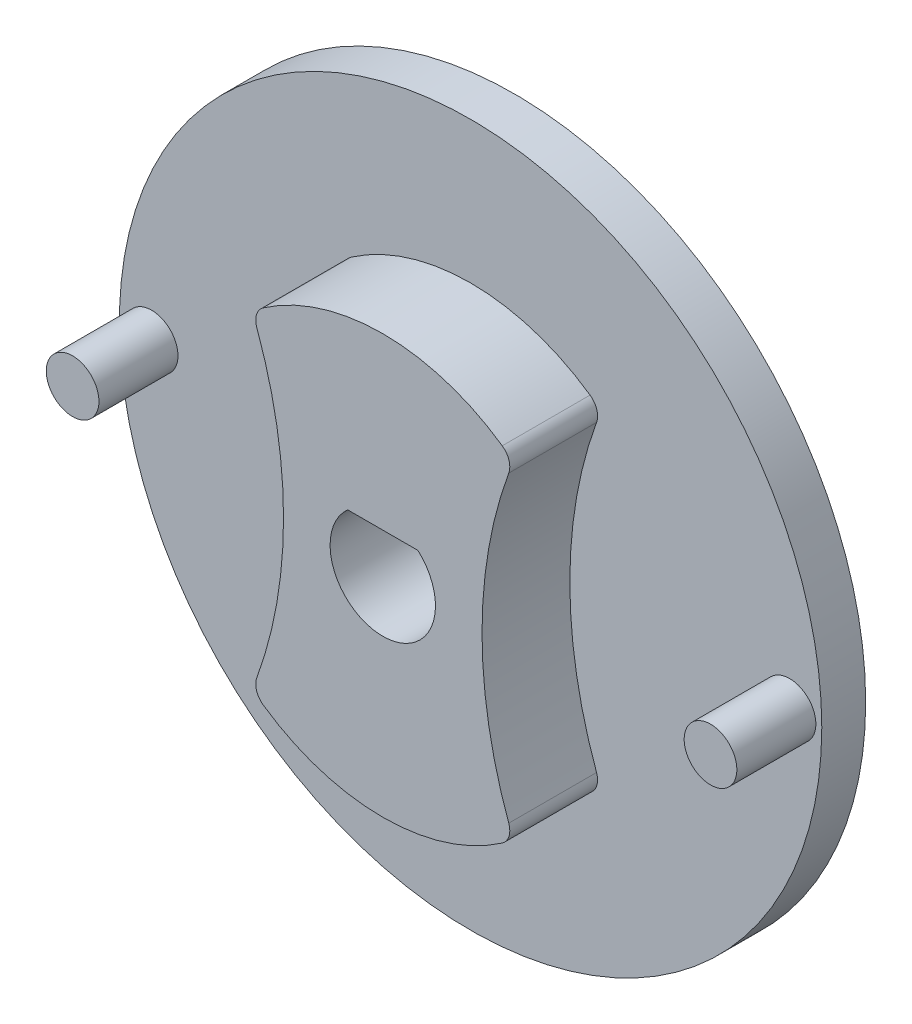
ISO-10303-21;
HEADER;
FILE_DESCRIPTION(('STEP AP214'),'2;1');
FILE_NAME('part.step','',(''),(''),'','','');
FILE_SCHEMA(('AUTOMOTIVE_DESIGN { 1 0 10303 214 1 1 1 1 }'));
ENDSEC;
DATA;
#1=APPLICATION_CONTEXT('core data for automotive mechanical design processes');
#2=APPLICATION_PROTOCOL_DEFINITION('international standard','automotive_design',2000,#1);
#3=PRODUCT_CONTEXT('',#1,'mechanical');
#4=PRODUCT('Part','Part','',(#3));
#5=PRODUCT_RELATED_PRODUCT_CATEGORY('part','',(#4));
#6=PRODUCT_DEFINITION_FORMATION('','',#4);
#7=PRODUCT_DEFINITION_CONTEXT('part definition',#1,'design');
#8=PRODUCT_DEFINITION('design','',#6,#7);
#9=PRODUCT_DEFINITION_SHAPE('','',#8);
#10=(LENGTH_UNIT() NAMED_UNIT(*) SI_UNIT(.MILLI.,.METRE.));
#11=(NAMED_UNIT(*) PLANE_ANGLE_UNIT() SI_UNIT($,.RADIAN.));
#12=(NAMED_UNIT(*) SI_UNIT($,.STERADIAN.) SOLID_ANGLE_UNIT());
#13=UNCERTAINTY_MEASURE_WITH_UNIT(LENGTH_MEASURE(1.E-05),#10,'distance_accuracy_value','');
#14=(GEOMETRIC_REPRESENTATION_CONTEXT(3) GLOBAL_UNCERTAINTY_ASSIGNED_CONTEXT((#13)) GLOBAL_UNIT_ASSIGNED_CONTEXT((#10,
#11,#12)) REPRESENTATION_CONTEXT('',''));
#15=CARTESIAN_POINT('',(0.,0.,0.));
#16=DIRECTION('',(0.,0.,1.));
#17=DIRECTION('',(1.,0.,0.));
#18=AXIS2_PLACEMENT_3D('',#15,#16,#17);
#19=CARTESIAN_POINT('',(19.6190681186798,0.948424737458792,4.99999999999989));
#20=DIRECTION('',(0.,0.,-1.));
#21=DIRECTION('',(-1.,0.,0.));
#22=AXIS2_PLACEMENT_3D('',#19,#20,#21);
#23=CYLINDRICAL_SURFACE('',#22,11.9262745781209);
#24=CARTESIAN_POINT('',(19.6190681186798,0.948424737458792,4.99999999999989));
#25=DIRECTION('',(0.,0.,1.));
#26=DIRECTION('',(1.,0.,0.));
#27=AXIS2_PLACEMENT_3D('',#24,#25,#26);
#28=CIRCLE('',#27,11.9262745781209);
#29=CARTESIAN_POINT('',(12.8153360364767,-8.84674014458034,5.));
#30=VERTEX_POINT('',#29);
#31=CARTESIAN_POINT('',(26.422800200883,-8.84674014458034,5.));
#32=VERTEX_POINT('',#31);
#33=EDGE_CURVE('E199',#30,#32,#28,.T.);
#34=ORIENTED_EDGE('',*,*,#33,.F.);
#35=DIRECTION('',(0.,0.,-1.));
#36=VECTOR('',#35,1.);
#37=CARTESIAN_POINT('',(12.8153360364767,-8.84674014458034,5.));
#38=LINE('',#37,#36);
#39=CARTESIAN_POINT('',(12.8153360364767,-8.84674014458031,0.));
#40=VERTEX_POINT('',#39);
#41=EDGE_CURVE('E232',#30,#40,#38,.T.);
#42=ORIENTED_EDGE('',*,*,#41,.T.);
#43=CARTESIAN_POINT('',(19.6190681186799,0.948424737458792,-1.11022302462516E-13));
#44=DIRECTION('',(0.,0.,1.));
#45=DIRECTION('',(1.,0.,0.));
#46=AXIS2_PLACEMENT_3D('',#43,#44,#45);
#47=CIRCLE('',#46,11.9262745781209);
#48=CARTESIAN_POINT('',(26.422800200883,-8.84674014458034,0.));
#49=VERTEX_POINT('',#48);
#50=EDGE_CURVE('E195',#40,#49,#47,.T.);
#51=ORIENTED_EDGE('',*,*,#50,.T.);
#52=DIRECTION('',(0.,0.,-1.));
#53=VECTOR('',#52,1.);
#54=CARTESIAN_POINT('',(26.422800200883,-8.84674014458034,5.));
#55=LINE('',#54,#53);
#56=EDGE_CURVE('E216',#49,#32,#55,.F.);
#57=ORIENTED_EDGE('',*,*,#56,.T.);
#58=EDGE_LOOP('',(#34,#42,#51,#57));
#59=FACE_BOUND('',#58,.T.);
#60=ADVANCED_FACE('F65',(#59),#23,.T.);
#61=CARTESIAN_POINT('',(50.5207675561745,0.948424737458792,5.));
#62=DIRECTION('',(0.,0.,-1.));
#63=DIRECTION('',(-1.,0.,0.));
#64=AXIS2_PLACEMENT_3D('',#61,#62,#63);
#65=CYLINDRICAL_SURFACE('',#64,25.25);
#66=CARTESIAN_POINT('',(50.5207675561745,0.948424737458792,5.));
#67=DIRECTION('',(0.,0.,-1.));
#68=DIRECTION('',(-1.,0.,0.));
#69=AXIS2_PLACEMENT_3D('',#66,#67,#68);
#70=CIRCLE('',#69,25.25);
#71=CARTESIAN_POINT('',(26.7920680791963,-7.68356930396963,5.));
#72=VERTEX_POINT('',#71);
#73=CARTESIAN_POINT('',(26.7920680791963,9.58041877888713,5.));
#74=VERTEX_POINT('',#73);
#75=EDGE_CURVE('E203',#72,#74,#70,.T.);
#76=ORIENTED_EDGE('',*,*,#75,.F.);
#77=DIRECTION('',(0.,0.,-1.));
#78=VECTOR('',#77,1.);
#79=CARTESIAN_POINT('',(26.7920680791963,-7.68356930396963,5.));
#80=LINE('',#79,#78);
#81=CARTESIAN_POINT('',(26.7920680791963,-7.6835693039696,0.));
#82=VERTEX_POINT('',#81);
#83=EDGE_CURVE('E258',#72,#82,#80,.T.);
#84=ORIENTED_EDGE('',*,*,#83,.T.);
#85=CARTESIAN_POINT('',(50.5207675561745,0.94842473745882,0.));
#86=DIRECTION('',(0.,0.,-1.));
#87=DIRECTION('',(-1.,0.,0.));
#88=AXIS2_PLACEMENT_3D('',#85,#86,#87);
#89=CIRCLE('',#88,25.25);
#90=CARTESIAN_POINT('',(26.7920680791963,9.58041877888716,0.));
#91=VERTEX_POINT('',#90);
#92=EDGE_CURVE('E220',#82,#91,#89,.T.);
#93=ORIENTED_EDGE('',*,*,#92,.T.);
#94=DIRECTION('',(0.,0.,-1.));
#95=VECTOR('',#94,1.);
#96=CARTESIAN_POINT('',(26.7920680791963,9.58041877888713,5.));
#97=LINE('',#96,#95);
#98=EDGE_CURVE('E255',#91,#74,#97,.F.);
#99=ORIENTED_EDGE('',*,*,#98,.T.);
#100=EDGE_LOOP('',(#76,#84,#93,#99));
#101=FACE_BOUND('',#100,.T.);
#102=ADVANCED_FACE('F280',(#101),#65,.F.);
#103=CARTESIAN_POINT('',(19.6190681186798,0.948424737458792,4.99999999999989));
#104=DIRECTION('',(0.,0.,-1.));
#105=DIRECTION('',(-1.,0.,0.));
#106=AXIS2_PLACEMENT_3D('',#103,#104,#105);
#107=CYLINDRICAL_SURFACE('',#106,11.9262745781209);
#108=CARTESIAN_POINT('',(19.6190681186798,0.948424737458792,4.99999999999989));
#109=DIRECTION('',(0.,0.,1.));
#110=DIRECTION('',(1.,0.,0.));
#111=AXIS2_PLACEMENT_3D('',#108,#109,#110);
#112=CIRCLE('',#111,11.9262745781209);
#113=CARTESIAN_POINT('',(26.422800200883,10.7435896194979,5.));
#114=VERTEX_POINT('',#113);
#115=CARTESIAN_POINT('',(12.8153360364767,10.7435896194979,4.99999999999989));
#116=VERTEX_POINT('',#115);
#117=EDGE_CURVE('E208',#114,#116,#112,.T.);
#118=ORIENTED_EDGE('',*,*,#117,.F.);
#119=DIRECTION('',(0.,0.,-1.));
#120=VECTOR('',#119,1.);
#121=CARTESIAN_POINT('',(26.422800200883,10.7435896194979,5.));
#122=LINE('',#121,#120);
#123=CARTESIAN_POINT('',(26.422800200883,10.7435896194979,0.));
#124=VERTEX_POINT('',#123);
#125=EDGE_CURVE('E265',#114,#124,#122,.T.);
#126=ORIENTED_EDGE('',*,*,#125,.T.);
#127=CARTESIAN_POINT('',(19.6190681186799,0.948424737458792,-1.11022302462516E-13));
#128=DIRECTION('',(0.,0.,1.));
#129=DIRECTION('',(1.,0.,0.));
#130=AXIS2_PLACEMENT_3D('',#127,#128,#129);
#131=CIRCLE('',#130,11.9262745781209);
#132=CARTESIAN_POINT('',(12.8153360364767,10.7435896194979,-1.11022302462516E-13));
#133=VERTEX_POINT('',#132);
#134=EDGE_CURVE('E224',#124,#133,#131,.T.);
#135=ORIENTED_EDGE('',*,*,#134,.T.);
#136=DIRECTION('',(0.,0.,-1.));
#137=VECTOR('',#136,1.);
#138=CARTESIAN_POINT('',(12.8153360364767,10.7435896194979,4.99999999999989));
#139=LINE('',#138,#137);
#140=EDGE_CURVE('E262',#133,#116,#139,.F.);
#141=ORIENTED_EDGE('',*,*,#140,.T.);
#142=EDGE_LOOP('',(#118,#126,#135,#141));
#143=FACE_BOUND('',#142,.T.);
#144=ADVANCED_FACE('F287',(#143),#107,.T.);
#145=CARTESIAN_POINT('',(-11.2826313188148,0.948424737458736,5.));
#146=DIRECTION('',(0.,0.,-1.));
#147=DIRECTION('',(-1.,0.,0.));
#148=AXIS2_PLACEMENT_3D('',#145,#146,#147);
#149=CYLINDRICAL_SURFACE('',#148,25.25);
#150=CARTESIAN_POINT('',(-11.2826313188148,0.948424737458736,0.));
#151=DIRECTION('',(0.,0.,-1.));
#152=DIRECTION('',(1.,0.,0.));
#153=AXIS2_PLACEMENT_3D('',#150,#151,#152);
#154=CIRCLE('',#153,25.25);
#155=CARTESIAN_POINT('',(12.4460681581634,9.58041877888718,0.));
#156=VERTEX_POINT('',#155);
#157=CARTESIAN_POINT('',(12.4460681581634,-7.6835693039696,0.));
#158=VERTEX_POINT('',#157);
#159=EDGE_CURVE('E204',#156,#158,#154,.T.);
#160=ORIENTED_EDGE('',*,*,#159,.T.);
#161=DIRECTION('',(0.,0.,-1.));
#162=VECTOR('',#161,1.);
#163=CARTESIAN_POINT('',(12.4460681581634,-7.6835693039696,5.));
#164=LINE('',#163,#162);
#165=CARTESIAN_POINT('',(12.4460681581634,-7.6835693039696,5.));
#166=VERTEX_POINT('',#165);
#167=EDGE_CURVE('E240',#158,#166,#164,.F.);
#168=ORIENTED_EDGE('',*,*,#167,.T.);
#169=CARTESIAN_POINT('',(-11.2826313188148,0.948424737458736,5.));
#170=DIRECTION('',(0.,0.,-1.));
#171=DIRECTION('',(1.,0.,0.));
#172=AXIS2_PLACEMENT_3D('',#169,#170,#171);
#173=CIRCLE('',#172,25.25);
#174=CARTESIAN_POINT('',(12.4460681581634,9.58041877888718,5.));
#175=VERTEX_POINT('',#174);
#176=EDGE_CURVE('E212',#175,#166,#173,.T.);
#177=ORIENTED_EDGE('',*,*,#176,.F.);
#178=DIRECTION('',(0.,0.,-1.));
#179=VECTOR('',#178,1.);
#180=CARTESIAN_POINT('',(12.4460681581634,9.58041877888718,5.));
#181=LINE('',#180,#179);
#182=EDGE_CURVE('E236',#175,#156,#181,.T.);
#183=ORIENTED_EDGE('',*,*,#182,.T.);
#184=EDGE_LOOP('',(#160,#168,#177,#183));
#185=FACE_BOUND('',#184,.T.);
#186=ADVANCED_FACE('F294',(#185),#149,.F.);
#187=CARTESIAN_POINT('',(35.0699178374272,0.948424737458764,5.));
#188=DIRECTION('',(0.,0.,1.));
#189=DIRECTION('',(1.,0.,0.));
#190=AXIS2_PLACEMENT_3D('',#187,#188,#189);
#191=PLANE('',#190);
#192=CARTESIAN_POINT('',(19.6190681186798,0.948424737458792,4.99999999999989));
#193=DIRECTION('',(0.,0.,1.));
#194=DIRECTION('',(1.,0.,0.));
#195=AXIS2_PLACEMENT_3D('',#192,#193,#194);
#196=CIRCLE('',#195,3.);
#197=CARTESIAN_POINT('',(17.6190681186799,3.18449271495855,5.));
#198=VERTEX_POINT('',#197);
#199=CARTESIAN_POINT('',(21.6190681186798,3.18449271495858,4.99999999999989));
#200=VERTEX_POINT('',#199);
#201=EDGE_CURVE('E145',#198,#200,#196,.T.);
#202=ORIENTED_EDGE('',*,*,#201,.F.);
#203=DIRECTION('',(-1.,0.,0.));
#204=VECTOR('',#203,1.);
#205=CARTESIAN_POINT('',(17.6190681186799,3.18449271495855,5.));
#206=LINE('',#205,#204);
#207=EDGE_CURVE('E157',#200,#198,#206,.T.);
#208=ORIENTED_EDGE('',*,*,#207,.F.);
#209=EDGE_LOOP('',(#202,#208));
#210=FACE_BOUND('',#209,.T.);
#211=ORIENTED_EDGE('',*,*,#176,.T.);
#212=CARTESIAN_POINT('',(13.3858186324992,-8.02543045412518,5.));
#213=DIRECTION('',(0.,0.,1.));
#214=DIRECTION('',(1.,0.,0.));
#215=AXIS2_PLACEMENT_3D('',#212,#213,#214);
#216=CIRCLE('',#215,1.);
#217=EDGE_CURVE('E252',#166,#30,#216,.T.);
#218=ORIENTED_EDGE('',*,*,#217,.T.);
#219=ORIENTED_EDGE('',*,*,#33,.T.);
#220=CARTESIAN_POINT('',(25.8523176048605,-8.02543045412521,5.));
#221=DIRECTION('',(0.,0.,1.));
#222=DIRECTION('',(1.,0.,0.));
#223=AXIS2_PLACEMENT_3D('',#220,#221,#222);
#224=CIRCLE('',#223,1.);
#225=EDGE_CURVE('E249',#32,#72,#224,.T.);
#226=ORIENTED_EDGE('',*,*,#225,.T.);
#227=ORIENTED_EDGE('',*,*,#75,.T.);
#228=CARTESIAN_POINT('',(25.8523176048605,9.92227992904277,5.));
#229=DIRECTION('',(0.,0.,1.));
#230=DIRECTION('',(1.,0.,0.));
#231=AXIS2_PLACEMENT_3D('',#228,#229,#230);
#232=CIRCLE('',#231,1.);
#233=EDGE_CURVE('E246',#74,#114,#232,.T.);
#234=ORIENTED_EDGE('',*,*,#233,.T.);
#235=ORIENTED_EDGE('',*,*,#117,.T.);
#236=CARTESIAN_POINT('',(13.3858186324992,9.92227992904277,5.));
#237=DIRECTION('',(0.,0.,1.));
#238=DIRECTION('',(1.,0.,0.));
#239=AXIS2_PLACEMENT_3D('',#236,#237,#238);
#240=CIRCLE('',#239,1.);
#241=EDGE_CURVE('E243',#116,#175,#240,.T.);
#242=ORIENTED_EDGE('',*,*,#241,.T.);
#243=EDGE_LOOP('',(#211,#218,#219,#226,#227,#234,#235,#242));
#244=FACE_BOUND('',#243,.T.);
#245=ADVANCED_FACE('F162',(#210,#244),#191,.T.);
#246=CARTESIAN_POINT('',(19.6190681186799,0.948424737458792,-1.11022302462516E-13));
#247=DIRECTION('',(0.,0.,1.));
#248=DIRECTION('',(1.,0.,0.));
#249=AXIS2_PLACEMENT_3D('',#246,#247,#248);
#250=PLANE('',#249);
#251=CARTESIAN_POINT('',(37.7826313188137,0.948424737458792,0.));
#252=DIRECTION('',(0.,0.,1.));
#253=DIRECTION('',(1.,0.,0.));
#254=AXIS2_PLACEMENT_3D('',#251,#252,#253);
#255=CIRCLE('',#254,1.5);
#256=CARTESIAN_POINT('',(39.2826313188137,0.948424737458792,0.));
#257=VERTEX_POINT('',#256);
#258=EDGE_CURVE('E153',#257,#257,#255,.T.);
#259=ORIENTED_EDGE('',*,*,#258,.F.);
#260=EDGE_LOOP('',(#259));
#261=FACE_BOUND('',#260,.T.);
#262=CARTESIAN_POINT('',(1.45550491854603,0.948424737458792,0.));
#263=DIRECTION('',(0.,0.,1.));
#264=DIRECTION('',(1.,0.,0.));
#265=AXIS2_PLACEMENT_3D('',#262,#263,#264);
#266=CIRCLE('',#265,1.5);
#267=CARTESIAN_POINT('',(2.95550491854603,0.948424737458792,0.));
#268=VERTEX_POINT('',#267);
#269=EDGE_CURVE('E179',#268,#268,#266,.T.);
#270=ORIENTED_EDGE('',*,*,#269,.F.);
#271=EDGE_LOOP('',(#270));
#272=FACE_BOUND('',#271,.T.);
#273=CARTESIAN_POINT('',(19.6190681186799,0.948424737458792,-1.11022302462516E-13));
#274=DIRECTION('',(0.,0.,1.));
#275=DIRECTION('',(1.,0.,0.));
#276=AXIS2_PLACEMENT_3D('',#273,#274,#275);
#277=CIRCLE('',#276,20.);
#278=CARTESIAN_POINT('',(39.6190681186799,0.948424737458792,-1.11022302462516E-13));
#279=VERTEX_POINT('',#278);
#280=EDGE_CURVE('E187',#279,#279,#277,.T.);
#281=ORIENTED_EDGE('',*,*,#280,.T.);
#282=EDGE_LOOP('',(#281));
#283=FACE_BOUND('',#282,.T.);
#284=ORIENTED_EDGE('',*,*,#50,.F.);
#285=CARTESIAN_POINT('',(13.3858186324992,-8.02543045412518,0.));
#286=DIRECTION('',(0.,0.,1.));
#287=DIRECTION('',(1.,0.,0.));
#288=AXIS2_PLACEMENT_3D('',#285,#286,#287);
#289=CIRCLE('',#288,1.);
#290=EDGE_CURVE('E268',#40,#158,#289,.F.);
#291=ORIENTED_EDGE('',*,*,#290,.T.);
#292=ORIENTED_EDGE('',*,*,#159,.F.);
#293=CARTESIAN_POINT('',(13.3858186324992,9.92227992904277,0.));
#294=DIRECTION('',(0.,0.,1.));
#295=DIRECTION('',(1.,0.,0.));
#296=AXIS2_PLACEMENT_3D('',#293,#294,#295);
#297=CIRCLE('',#296,1.);
#298=EDGE_CURVE('E13',#156,#133,#297,.F.);
#299=ORIENTED_EDGE('',*,*,#298,.T.);
#300=ORIENTED_EDGE('',*,*,#134,.F.);
#301=CARTESIAN_POINT('',(25.8523176048605,9.92227992904277,0.));
#302=DIRECTION('',(0.,0.,1.));
#303=DIRECTION('',(1.,0.,0.));
#304=AXIS2_PLACEMENT_3D('',#301,#302,#303);
#305=CIRCLE('',#304,1.);
#306=EDGE_CURVE('E74',#124,#91,#305,.F.);
#307=ORIENTED_EDGE('',*,*,#306,.T.);
#308=ORIENTED_EDGE('',*,*,#92,.F.);
#309=CARTESIAN_POINT('',(25.8523176048605,-8.02543045412518,0.));
#310=DIRECTION('',(0.,0.,1.));
#311=DIRECTION('',(1.,0.,0.));
#312=AXIS2_PLACEMENT_3D('',#309,#310,#311);
#313=CIRCLE('',#312,1.);
#314=EDGE_CURVE('E271',#82,#49,#313,.F.);
#315=ORIENTED_EDGE('',*,*,#314,.T.);
#316=EDGE_LOOP('',(#284,#291,#292,#299,#300,#307,#308,#315));
#317=FACE_BOUND('',#316,.T.);
#318=ADVANCED_FACE('F277',(#261,#272,#283,#317),#250,.T.);
#319=CARTESIAN_POINT('',(19.6190681186798,0.948424737458764,-2.50000000000006));
#320=DIRECTION('',(0.,0.,1.));
#321=DIRECTION('',(1.,0.,0.));
#322=AXIS2_PLACEMENT_3D('',#319,#320,#321);
#323=CYLINDRICAL_SURFACE('',#322,20.);
#324=CARTESIAN_POINT('',(19.6190681186798,0.948424737458764,-2.50000000000006));
#325=DIRECTION('',(0.,0.,1.));
#326=DIRECTION('',(1.,0.,0.));
#327=AXIS2_PLACEMENT_3D('',#324,#325,#326);
#328=CIRCLE('',#327,20.);
#329=CARTESIAN_POINT('',(39.6190681186799,0.948424737458764,-2.50000000000006));
#330=VERTEX_POINT('',#329);
#331=EDGE_CURVE('E191',#330,#330,#328,.T.);
#332=ORIENTED_EDGE('',*,*,#331,.T.);
#333=EDGE_LOOP('',(#332));
#334=FACE_BOUND('',#333,.T.);
#335=ORIENTED_EDGE('',*,*,#280,.F.);
#336=EDGE_LOOP('',(#335));
#337=FACE_BOUND('',#336,.T.);
#338=ADVANCED_FACE('F325',(#334,#337),#323,.T.);
#339=CARTESIAN_POINT('',(19.6190681186798,0.948424737458764,-2.50000000000006));
#340=DIRECTION('',(0.,0.,1.));
#341=DIRECTION('',(1.,0.,0.));
#342=AXIS2_PLACEMENT_3D('',#339,#340,#341);
#343=PLANE('',#342);
#344=DIRECTION('',(-1.,0.,0.));
#345=VECTOR('',#344,1.);
#346=CARTESIAN_POINT('',(17.6190681186798,3.18449271495852,-2.50000000000006));
#347=LINE('',#346,#345);
#348=CARTESIAN_POINT('',(21.6190681186798,3.18449271495858,-2.50000000000006));
#349=VERTEX_POINT('',#348);
#350=CARTESIAN_POINT('',(17.6190681186798,3.18449271495852,-2.50000000000006));
#351=VERTEX_POINT('',#350);
#352=EDGE_CURVE('E170',#349,#351,#347,.T.);
#353=ORIENTED_EDGE('',*,*,#352,.T.);
#354=CARTESIAN_POINT('',(19.6190681186798,0.948424737458764,-2.50000000000006));
#355=DIRECTION('',(0.,0.,1.));
#356=DIRECTION('',(1.,0.,0.));
#357=AXIS2_PLACEMENT_3D('',#354,#355,#356);
#358=CIRCLE('',#357,3.);
#359=EDGE_CURVE('E148',#351,#349,#358,.T.);
#360=ORIENTED_EDGE('',*,*,#359,.T.);
#361=EDGE_LOOP('',(#353,#360));
#362=FACE_BOUND('',#361,.T.);
#363=ORIENTED_EDGE('',*,*,#331,.F.);
#364=EDGE_LOOP('',(#363));
#365=FACE_BOUND('',#364,.T.);
#366=ADVANCED_FACE('F328',(#362,#365),#343,.F.);
#367=CARTESIAN_POINT('',(1.45550491854603,0.948424737458792,4.50000000000006));
#368=DIRECTION('',(0.,0.,-1.));
#369=DIRECTION('',(-1.,0.,0.));
#370=AXIS2_PLACEMENT_3D('',#367,#368,#369);
#371=CYLINDRICAL_SURFACE('',#370,1.5);
#372=CARTESIAN_POINT('',(1.45550491854603,0.948424737458792,4.50000000000006));
#373=DIRECTION('',(0.,0.,1.));
#374=DIRECTION('',(1.,0.,0.));
#375=AXIS2_PLACEMENT_3D('',#372,#373,#374);
#376=CIRCLE('',#375,1.5);
#377=CARTESIAN_POINT('',(2.95550491854603,0.948424737458792,4.50000000000006));
#378=VERTEX_POINT('',#377);
#379=EDGE_CURVE('E183',#378,#378,#376,.T.);
#380=ORIENTED_EDGE('',*,*,#379,.F.);
#381=EDGE_LOOP('',(#380));
#382=FACE_BOUND('',#381,.T.);
#383=ORIENTED_EDGE('',*,*,#269,.T.);
#384=EDGE_LOOP('',(#383));
#385=FACE_BOUND('',#384,.T.);
#386=ADVANCED_FACE('F335',(#382,#385),#371,.T.);
#387=CARTESIAN_POINT('',(1.45550491854603,0.948424737458792,4.50000000000006));
#388=DIRECTION('',(0.,0.,1.));
#389=DIRECTION('',(1.,0.,0.));
#390=AXIS2_PLACEMENT_3D('',#387,#388,#389);
#391=PLANE('',#390);
#392=ORIENTED_EDGE('',*,*,#379,.T.);
#393=EDGE_LOOP('',(#392));
#394=FACE_BOUND('',#393,.T.);
#395=ADVANCED_FACE('F339',(#394),#391,.T.);
#396=CARTESIAN_POINT('',(37.7826313188137,0.948424737458792,4.49999999999995));
#397=DIRECTION('',(0.,0.,-1.));
#398=DIRECTION('',(-1.,0.,0.));
#399=AXIS2_PLACEMENT_3D('',#396,#397,#398);
#400=CYLINDRICAL_SURFACE('',#399,1.5);
#401=CARTESIAN_POINT('',(37.7826313188137,0.948424737458792,4.49999999999995));
#402=DIRECTION('',(0.,0.,1.));
#403=DIRECTION('',(1.,0.,0.));
#404=AXIS2_PLACEMENT_3D('',#401,#402,#403);
#405=CIRCLE('',#404,1.5);
#406=CARTESIAN_POINT('',(39.2826313188137,0.948424737458792,4.49999999999995));
#407=VERTEX_POINT('',#406);
#408=EDGE_CURVE('E175',#407,#407,#405,.T.);
#409=ORIENTED_EDGE('',*,*,#408,.F.);
#410=EDGE_LOOP('',(#409));
#411=FACE_BOUND('',#410,.T.);
#412=ORIENTED_EDGE('',*,*,#258,.T.);
#413=EDGE_LOOP('',(#412));
#414=FACE_BOUND('',#413,.T.);
#415=ADVANCED_FACE('F343',(#411,#414),#400,.T.);
#416=CARTESIAN_POINT('',(37.7826313188137,0.948424737458792,4.49999999999995));
#417=DIRECTION('',(0.,0.,1.));
#418=DIRECTION('',(1.,0.,0.));
#419=AXIS2_PLACEMENT_3D('',#416,#417,#418);
#420=PLANE('',#419);
#421=ORIENTED_EDGE('',*,*,#408,.T.);
#422=EDGE_LOOP('',(#421));
#423=FACE_BOUND('',#422,.T.);
#424=ADVANCED_FACE('F347',(#423),#420,.T.);
#425=CARTESIAN_POINT('',(19.6190681186798,0.948424737458764,-2.50000000000006));
#426=DIRECTION('',(0.,0.,1.));
#427=DIRECTION('',(1.,0.,0.));
#428=AXIS2_PLACEMENT_3D('',#425,#426,#427);
#429=CYLINDRICAL_SURFACE('',#428,3.);
#430=DIRECTION('',(0.,0.,1.));
#431=VECTOR('',#430,1.);
#432=CARTESIAN_POINT('',(21.6190681186798,3.18449271495858,-2.50000000000006));
#433=LINE('',#432,#431);
#434=EDGE_CURVE('E154',#349,#200,#433,.T.);
#435=ORIENTED_EDGE('',*,*,#434,.F.);
#436=ORIENTED_EDGE('',*,*,#359,.F.);
#437=DIRECTION('',(0.,0.,1.));
#438=VECTOR('',#437,1.);
#439=CARTESIAN_POINT('',(17.6190681186798,3.18449271495852,-2.50000000000006));
#440=LINE('',#439,#438);
#441=EDGE_CURVE('E141',#351,#198,#440,.T.);
#442=ORIENTED_EDGE('',*,*,#441,.T.);
#443=ORIENTED_EDGE('',*,*,#201,.T.);
#444=EDGE_LOOP('',(#435,#436,#442,#443));
#445=FACE_BOUND('',#444,.T.);
#446=ADVANCED_FACE('F143',(#445),#429,.F.);
#447=CARTESIAN_POINT('',(17.6190681186798,3.18449271495852,-2.50000000000006));
#448=DIRECTION('',(0.,1.,0.));
#449=DIRECTION('',(0.,0.,1.));
#450=AXIS2_PLACEMENT_3D('',#447,#448,#449);
#451=PLANE('',#450);
#452=ORIENTED_EDGE('',*,*,#441,.F.);
#453=ORIENTED_EDGE('',*,*,#352,.F.);
#454=ORIENTED_EDGE('',*,*,#434,.T.);
#455=ORIENTED_EDGE('',*,*,#207,.T.);
#456=EDGE_LOOP('',(#452,#453,#454,#455));
#457=FACE_BOUND('',#456,.T.);
#458=ADVANCED_FACE('F158',(#457),#451,.F.);
#459=CARTESIAN_POINT('',(13.3858186324992,-8.02543045412518,5.));
#460=DIRECTION('',(0.,0.,1.));
#461=DIRECTION('',(1.,0.,0.));
#462=AXIS2_PLACEMENT_3D('',#459,#460,#461);
#463=CYLINDRICAL_SURFACE('',#462,1.);
#464=ORIENTED_EDGE('',*,*,#217,.F.);
#465=ORIENTED_EDGE('',*,*,#167,.F.);
#466=ORIENTED_EDGE('',*,*,#290,.F.);
#467=ORIENTED_EDGE('',*,*,#41,.F.);
#468=EDGE_LOOP('',(#464,#465,#466,#467));
#469=FACE_BOUND('',#468,.T.);
#470=ADVANCED_FACE('F297',(#469),#463,.T.);
#471=CARTESIAN_POINT('',(25.8523176048605,-8.02543045412521,5.));
#472=DIRECTION('',(0.,0.,1.));
#473=DIRECTION('',(1.,0.,0.));
#474=AXIS2_PLACEMENT_3D('',#471,#472,#473);
#475=CYLINDRICAL_SURFACE('',#474,1.);
#476=ORIENTED_EDGE('',*,*,#225,.F.);
#477=ORIENTED_EDGE('',*,*,#56,.F.);
#478=ORIENTED_EDGE('',*,*,#314,.F.);
#479=ORIENTED_EDGE('',*,*,#83,.F.);
#480=EDGE_LOOP('',(#476,#477,#478,#479));
#481=FACE_BOUND('',#480,.T.);
#482=ADVANCED_FACE('F304',(#481),#475,.T.);
#483=CARTESIAN_POINT('',(25.8523176048605,9.92227992904277,5.));
#484=DIRECTION('',(0.,0.,1.));
#485=DIRECTION('',(1.,0.,0.));
#486=AXIS2_PLACEMENT_3D('',#483,#484,#485);
#487=CYLINDRICAL_SURFACE('',#486,1.);
#488=ORIENTED_EDGE('',*,*,#233,.F.);
#489=ORIENTED_EDGE('',*,*,#98,.F.);
#490=ORIENTED_EDGE('',*,*,#306,.F.);
#491=ORIENTED_EDGE('',*,*,#125,.F.);
#492=EDGE_LOOP('',(#488,#489,#490,#491));
#493=FACE_BOUND('',#492,.T.);
#494=ADVANCED_FACE('F283',(#493),#487,.T.);
#495=CARTESIAN_POINT('',(13.3858186324992,9.92227992904277,5.));
#496=DIRECTION('',(0.,0.,1.));
#497=DIRECTION('',(1.,0.,0.));
#498=AXIS2_PLACEMENT_3D('',#495,#496,#497);
#499=CYLINDRICAL_SURFACE('',#498,1.);
#500=ORIENTED_EDGE('',*,*,#241,.F.);
#501=ORIENTED_EDGE('',*,*,#140,.F.);
#502=ORIENTED_EDGE('',*,*,#298,.F.);
#503=ORIENTED_EDGE('',*,*,#182,.F.);
#504=EDGE_LOOP('',(#500,#501,#502,#503));
#505=FACE_BOUND('',#504,.T.);
#506=ADVANCED_FACE('F67',(#505),#499,.T.);
#507=CLOSED_SHELL('',(#60,#102,#144,#186,#245,#318,#338,#366,#386,#395,#415,#424,#446,#458,#470,
#482,#494,#506));
#508=MANIFOLD_SOLID_BREP('B2',#507);
#509=ADVANCED_BREP_SHAPE_REPRESENTATION('',(#18,#508),#14);
#510=SHAPE_DEFINITION_REPRESENTATION(#9,#509);
ENDSEC;
END-ISO-10303-21;
